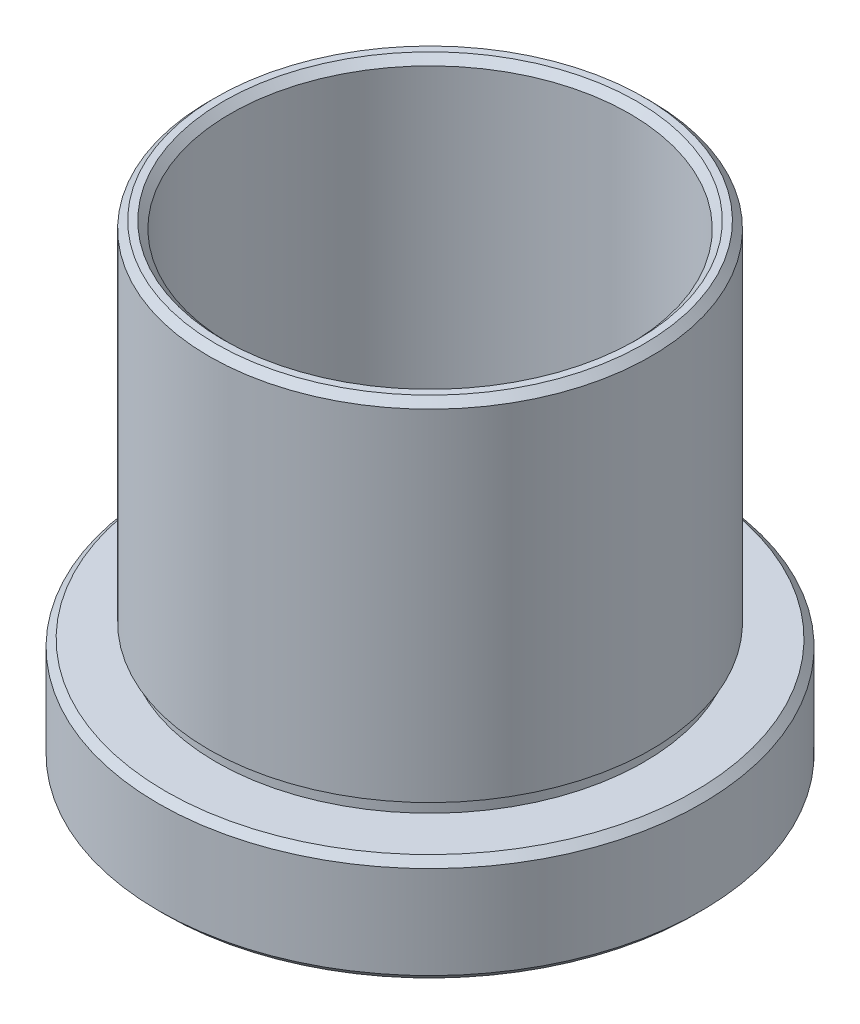
ISO-10303-21;
HEADER;
FILE_DESCRIPTION(('STEP AP214'),'2;1');
FILE_NAME('part.step','',(''),(''),'','','');
FILE_SCHEMA(('AUTOMOTIVE_DESIGN { 1 0 10303 214 1 1 1 1 }'));
ENDSEC;
DATA;
#1=APPLICATION_CONTEXT('core data for automotive mechanical design processes');
#2=APPLICATION_PROTOCOL_DEFINITION('international standard','automotive_design',2000,#1);
#3=PRODUCT_CONTEXT('',#1,'mechanical');
#4=PRODUCT('Part','Part','',(#3));
#5=PRODUCT_RELATED_PRODUCT_CATEGORY('part','',(#4));
#6=PRODUCT_DEFINITION_FORMATION('','',#4);
#7=PRODUCT_DEFINITION_CONTEXT('part definition',#1,'design');
#8=PRODUCT_DEFINITION('design','',#6,#7);
#9=PRODUCT_DEFINITION_SHAPE('','',#8);
#10=(LENGTH_UNIT() NAMED_UNIT(*) SI_UNIT(.MILLI.,.METRE.));
#11=(NAMED_UNIT(*) PLANE_ANGLE_UNIT() SI_UNIT($,.RADIAN.));
#12=(NAMED_UNIT(*) SI_UNIT($,.STERADIAN.) SOLID_ANGLE_UNIT());
#13=UNCERTAINTY_MEASURE_WITH_UNIT(LENGTH_MEASURE(1.E-05),#10,'distance_accuracy_value','');
#14=(GEOMETRIC_REPRESENTATION_CONTEXT(3) GLOBAL_UNCERTAINTY_ASSIGNED_CONTEXT((#13)) GLOBAL_UNIT_ASSIGNED_CONTEXT((#10,
#11,#12)) REPRESENTATION_CONTEXT('',''));
#15=CARTESIAN_POINT('',(0.,0.,0.));
#16=DIRECTION('',(0.,0.,1.));
#17=DIRECTION('',(1.,0.,0.));
#18=AXIS2_PLACEMENT_3D('',#15,#16,#17);
#19=CARTESIAN_POINT('',(15.5,2.64285417456689,0.));
#20=DIRECTION('',(0.,1.,0.));
#21=DIRECTION('',(0.,0.,1.));
#22=AXIS2_PLACEMENT_3D('',#19,#20,#21);
#23=PLANE('',#22);
#24=CARTESIAN_POINT('',(0.,2.6428541745669,0.));
#25=DIRECTION('',(0.,1.,0.));
#26=DIRECTION('',(0.,0.,1.));
#27=AXIS2_PLACEMENT_3D('',#24,#25,#26);
#28=CIRCLE('',#27,15.5);
#29=CARTESIAN_POINT('',(0.,2.6428541745669,15.5));
#30=VERTEX_POINT('',#29);
#31=EDGE_CURVE('E10',#30,#30,#28,.T.);
#32=ORIENTED_EDGE('',*,*,#31,.F.);
#33=EDGE_LOOP('',(#32));
#34=FACE_BOUND('',#33,.T.);
#35=CARTESIAN_POINT('',(0.,2.6428541745669,0.));
#36=DIRECTION('',(0.,1.,0.));
#37=DIRECTION('',(0.,0.,1.));
#38=AXIS2_PLACEMENT_3D('',#35,#36,#37);
#39=CIRCLE('',#38,15.);
#40=CARTESIAN_POINT('',(0.,2.6428541745669,15.));
#41=VERTEX_POINT('',#40);
#42=EDGE_CURVE('E112',#41,#41,#39,.T.);
#43=ORIENTED_EDGE('',*,*,#42,.T.);
#44=EDGE_LOOP('',(#43));
#45=FACE_BOUND('',#44,.T.);
#46=ADVANCED_FACE('F41',(#34,#45),#23,.F.);
#47=CARTESIAN_POINT('',(0.,44.5985977452931,0.));
#48=DIRECTION('',(0.,1.,0.));
#49=DIRECTION('',(0.,0.,1.));
#50=AXIS2_PLACEMENT_3D('',#47,#48,#49);
#51=CYLINDRICAL_SURFACE('',#50,15.5);
#52=CARTESIAN_POINT('',(0.,26.5428541745669,0.));
#53=DIRECTION('',(0.,1.,0.));
#54=DIRECTION('',(0.,0.,1.));
#55=AXIS2_PLACEMENT_3D('',#52,#53,#54);
#56=CIRCLE('',#55,15.5);
#57=CARTESIAN_POINT('',(0.,26.5428541745669,15.5));
#58=VERTEX_POINT('',#57);
#59=EDGE_CURVE('E48',#58,#58,#56,.T.);
#60=ORIENTED_EDGE('',*,*,#59,.F.);
#61=EDGE_LOOP('',(#60));
#62=FACE_BOUND('',#61,.T.);
#63=ORIENTED_EDGE('',*,*,#31,.T.);
#64=EDGE_LOOP('',(#63));
#65=FACE_BOUND('',#64,.T.);
#66=ADVANCED_FACE('F204',(#62,#65),#51,.T.);
#67=CARTESIAN_POINT('',(0.,26.5428541745669,0.));
#68=DIRECTION('',(0.,-1.,0.));
#69=DIRECTION('',(0.,0.,-1.));
#70=AXIS2_PLACEMENT_3D('',#67,#68,#69);
#71=CONICAL_SURFACE('',#70,15.5,0.785398163397448);
#72=CARTESIAN_POINT('',(0.,27.0428541745669,0.));
#73=DIRECTION('',(0.,1.,0.));
#74=DIRECTION('',(0.,0.,1.));
#75=AXIS2_PLACEMENT_3D('',#72,#73,#74);
#76=CIRCLE('',#75,15.);
#77=CARTESIAN_POINT('',(0.,27.0428541745669,15.));
#78=VERTEX_POINT('',#77);
#79=EDGE_CURVE('E54',#78,#78,#76,.T.);
#80=ORIENTED_EDGE('',*,*,#79,.F.);
#81=EDGE_LOOP('',(#80));
#82=FACE_BOUND('',#81,.T.);
#83=ORIENTED_EDGE('',*,*,#59,.T.);
#84=EDGE_LOOP('',(#83));
#85=FACE_BOUND('',#84,.T.);
#86=ADVANCED_FACE('F199',(#82,#85),#71,.T.);
#87=CARTESIAN_POINT('',(14.5,27.0428541745669,0.));
#88=DIRECTION('',(0.,-1.,0.));
#89=DIRECTION('',(0.,0.,-1.));
#90=AXIS2_PLACEMENT_3D('',#87,#88,#89);
#91=PLANE('',#90);
#92=CARTESIAN_POINT('',(0.,27.0428541745669,0.));
#93=DIRECTION('',(0.,1.,0.));
#94=DIRECTION('',(0.,0.,1.));
#95=AXIS2_PLACEMENT_3D('',#92,#93,#94);
#96=CIRCLE('',#95,14.5);
#97=CARTESIAN_POINT('',(0.,27.0428541745669,14.5));
#98=VERTEX_POINT('',#97);
#99=EDGE_CURVE('E59',#98,#98,#96,.T.);
#100=ORIENTED_EDGE('',*,*,#99,.F.);
#101=EDGE_LOOP('',(#100));
#102=FACE_BOUND('',#101,.T.);
#103=ORIENTED_EDGE('',*,*,#79,.T.);
#104=EDGE_LOOP('',(#103));
#105=FACE_BOUND('',#104,.T.);
#106=ADVANCED_FACE('F193',(#102,#105),#91,.F.);
#107=CARTESIAN_POINT('',(0.,27.0428541745669,0.));
#108=DIRECTION('',(0.,1.,0.));
#109=DIRECTION('',(0.,0.,1.));
#110=AXIS2_PLACEMENT_3D('',#107,#108,#109);
#111=CONICAL_SURFACE('',#110,14.5,0.78539816339745);
#112=CARTESIAN_POINT('',(0.,26.5428541745669,0.));
#113=DIRECTION('',(0.,1.,0.));
#114=DIRECTION('',(0.,0.,1.));
#115=AXIS2_PLACEMENT_3D('',#112,#113,#114);
#116=CIRCLE('',#115,14.);
#117=CARTESIAN_POINT('',(0.,26.5428541745669,14.));
#118=VERTEX_POINT('',#117);
#119=EDGE_CURVE('E65',#118,#118,#116,.T.);
#120=ORIENTED_EDGE('',*,*,#119,.F.);
#121=EDGE_LOOP('',(#120));
#122=FACE_BOUND('',#121,.T.);
#123=ORIENTED_EDGE('',*,*,#99,.T.);
#124=EDGE_LOOP('',(#123));
#125=FACE_BOUND('',#124,.T.);
#126=ADVANCED_FACE('F187',(#122,#125),#111,.F.);
#127=CARTESIAN_POINT('',(0.,44.5985977452931,0.));
#128=DIRECTION('',(0.,1.,0.));
#129=DIRECTION('',(0.,0.,1.));
#130=AXIS2_PLACEMENT_3D('',#127,#128,#129);
#131=CYLINDRICAL_SURFACE('',#130,14.);
#132=CARTESIAN_POINT('',(0.,-0.357145825433107,0.));
#133=DIRECTION('',(0.,1.,0.));
#134=DIRECTION('',(0.,0.,1.));
#135=AXIS2_PLACEMENT_3D('',#132,#133,#134);
#136=CIRCLE('',#135,14.);
#137=CARTESIAN_POINT('',(0.,-0.357145825433107,14.));
#138=VERTEX_POINT('',#137);
#139=EDGE_CURVE('E68',#138,#138,#136,.T.);
#140=ORIENTED_EDGE('',*,*,#139,.F.);
#141=EDGE_LOOP('',(#140));
#142=FACE_BOUND('',#141,.T.);
#143=ORIENTED_EDGE('',*,*,#119,.T.);
#144=EDGE_LOOP('',(#143));
#145=FACE_BOUND('',#144,.T.);
#146=ADVANCED_FACE('F181',(#142,#145),#131,.F.);
#147=CARTESIAN_POINT('',(17.6,-0.357145825433105,0.));
#148=DIRECTION('',(0.,1.,0.));
#149=DIRECTION('',(0.,0.,1.));
#150=AXIS2_PLACEMENT_3D('',#147,#148,#149);
#151=PLANE('',#150);
#152=CARTESIAN_POINT('',(0.,-0.357145825433107,0.));
#153=DIRECTION('',(0.,1.,0.));
#154=DIRECTION('',(0.,0.,1.));
#155=AXIS2_PLACEMENT_3D('',#152,#153,#154);
#156=CIRCLE('',#155,17.6);
#157=CARTESIAN_POINT('',(0.,-0.357145825433107,17.6));
#158=VERTEX_POINT('',#157);
#159=EDGE_CURVE('E72',#158,#158,#156,.T.);
#160=ORIENTED_EDGE('',*,*,#159,.F.);
#161=EDGE_LOOP('',(#160));
#162=FACE_BOUND('',#161,.T.);
#163=ORIENTED_EDGE('',*,*,#139,.T.);
#164=EDGE_LOOP('',(#163));
#165=FACE_BOUND('',#164,.T.);
#166=ADVANCED_FACE('F175',(#162,#165),#151,.F.);
#167=CARTESIAN_POINT('',(0.,44.5985977452931,0.));
#168=DIRECTION('',(0.,1.,0.));
#169=DIRECTION('',(0.,0.,1.));
#170=AXIS2_PLACEMENT_3D('',#167,#168,#169);
#171=CYLINDRICAL_SURFACE('',#170,17.6);
#172=CARTESIAN_POINT('',(0.,-1.35714582543311,0.));
#173=DIRECTION('',(0.,1.,0.));
#174=DIRECTION('',(0.,0.,1.));
#175=AXIS2_PLACEMENT_3D('',#172,#173,#174);
#176=CIRCLE('',#175,17.6);
#177=CARTESIAN_POINT('',(0.,-1.35714582543311,17.6));
#178=VERTEX_POINT('',#177);
#179=EDGE_CURVE('E76',#178,#178,#176,.T.);
#180=ORIENTED_EDGE('',*,*,#179,.F.);
#181=EDGE_LOOP('',(#180));
#182=FACE_BOUND('',#181,.T.);
#183=ORIENTED_EDGE('',*,*,#159,.T.);
#184=EDGE_LOOP('',(#183));
#185=FACE_BOUND('',#184,.T.);
#186=ADVANCED_FACE('F169',(#182,#185),#171,.F.);
#187=CARTESIAN_POINT('',(17.5,-1.35714582543311,0.));
#188=DIRECTION('',(0.,-1.,0.));
#189=DIRECTION('',(0.,0.,-1.));
#190=AXIS2_PLACEMENT_3D('',#187,#188,#189);
#191=PLANE('',#190);
#192=CARTESIAN_POINT('',(0.,-1.35714582543311,0.));
#193=DIRECTION('',(0.,1.,0.));
#194=DIRECTION('',(0.,0.,1.));
#195=AXIS2_PLACEMENT_3D('',#192,#193,#194);
#196=CIRCLE('',#195,17.5);
#197=CARTESIAN_POINT('',(0.,-1.35714582543311,17.5));
#198=VERTEX_POINT('',#197);
#199=EDGE_CURVE('E80',#198,#198,#196,.T.);
#200=ORIENTED_EDGE('',*,*,#199,.F.);
#201=EDGE_LOOP('',(#200));
#202=FACE_BOUND('',#201,.T.);
#203=ORIENTED_EDGE('',*,*,#179,.T.);
#204=EDGE_LOOP('',(#203));
#205=FACE_BOUND('',#204,.T.);
#206=ADVANCED_FACE('F163',(#202,#205),#191,.F.);
#207=CARTESIAN_POINT('',(0.,44.5985977452931,0.));
#208=DIRECTION('',(0.,1.,0.));
#209=DIRECTION('',(0.,0.,1.));
#210=AXIS2_PLACEMENT_3D('',#207,#208,#209);
#211=CYLINDRICAL_SURFACE('',#210,17.5);
#212=CARTESIAN_POINT('',(0.,-5.3571458254331,0.));
#213=DIRECTION('',(0.,1.,0.));
#214=DIRECTION('',(0.,0.,1.));
#215=AXIS2_PLACEMENT_3D('',#212,#213,#214);
#216=CIRCLE('',#215,17.5);
#217=CARTESIAN_POINT('',(0.,-5.3571458254331,17.5));
#218=VERTEX_POINT('',#217);
#219=EDGE_CURVE('E84',#218,#218,#216,.T.);
#220=ORIENTED_EDGE('',*,*,#219,.F.);
#221=EDGE_LOOP('',(#220));
#222=FACE_BOUND('',#221,.T.);
#223=ORIENTED_EDGE('',*,*,#199,.T.);
#224=EDGE_LOOP('',(#223));
#225=FACE_BOUND('',#224,.T.);
#226=ADVANCED_FACE('F157',(#222,#225),#211,.F.);
#227=CARTESIAN_POINT('',(0.,-5.3571458254331,0.));
#228=DIRECTION('',(0.,-1.,0.));
#229=DIRECTION('',(0.,0.,-1.));
#230=AXIS2_PLACEMENT_3D('',#227,#228,#229);
#231=CONICAL_SURFACE('',#230,17.5,0.785398163397448);
#232=CARTESIAN_POINT('',(0.,-5.85714582543311,0.));
#233=DIRECTION('',(0.,1.,0.));
#234=DIRECTION('',(0.,0.,1.));
#235=AXIS2_PLACEMENT_3D('',#232,#233,#234);
#236=CIRCLE('',#235,18.);
#237=CARTESIAN_POINT('',(0.,-5.85714582543311,18.));
#238=VERTEX_POINT('',#237);
#239=EDGE_CURVE('E88',#238,#238,#236,.T.);
#240=ORIENTED_EDGE('',*,*,#239,.F.);
#241=EDGE_LOOP('',(#240));
#242=FACE_BOUND('',#241,.T.);
#243=ORIENTED_EDGE('',*,*,#219,.T.);
#244=EDGE_LOOP('',(#243));
#245=FACE_BOUND('',#244,.T.);
#246=ADVANCED_FACE('F151',(#242,#245),#231,.F.);
#247=CARTESIAN_POINT('',(18.55,-5.85714582543311,0.));
#248=DIRECTION('',(0.,1.,0.));
#249=DIRECTION('',(0.,0.,1.));
#250=AXIS2_PLACEMENT_3D('',#247,#248,#249);
#251=PLANE('',#250);
#252=CARTESIAN_POINT('',(0.,-5.85714582543311,0.));
#253=DIRECTION('',(0.,1.,0.));
#254=DIRECTION('',(0.,0.,1.));
#255=AXIS2_PLACEMENT_3D('',#252,#253,#254);
#256=CIRCLE('',#255,18.55);
#257=CARTESIAN_POINT('',(0.,-5.85714582543311,18.55));
#258=VERTEX_POINT('',#257);
#259=EDGE_CURVE('E92',#258,#258,#256,.T.);
#260=ORIENTED_EDGE('',*,*,#259,.F.);
#261=EDGE_LOOP('',(#260));
#262=FACE_BOUND('',#261,.T.);
#263=ORIENTED_EDGE('',*,*,#239,.T.);
#264=EDGE_LOOP('',(#263));
#265=FACE_BOUND('',#264,.T.);
#266=ADVANCED_FACE('F145',(#262,#265),#251,.F.);
#267=CARTESIAN_POINT('',(0.,-5.85714582543311,0.));
#268=DIRECTION('',(0.,1.,0.));
#269=DIRECTION('',(0.,0.,1.));
#270=AXIS2_PLACEMENT_3D('',#267,#268,#269);
#271=CONICAL_SURFACE('',#270,18.55,0.785398163397448);
#272=CARTESIAN_POINT('',(0.,-5.3571458254331,0.));
#273=DIRECTION('',(0.,1.,0.));
#274=DIRECTION('',(0.,0.,1.));
#275=AXIS2_PLACEMENT_3D('',#272,#273,#274);
#276=CIRCLE('',#275,19.05);
#277=CARTESIAN_POINT('',(0.,-5.3571458254331,19.05));
#278=VERTEX_POINT('',#277);
#279=EDGE_CURVE('E96',#278,#278,#276,.T.);
#280=ORIENTED_EDGE('',*,*,#279,.F.);
#281=EDGE_LOOP('',(#280));
#282=FACE_BOUND('',#281,.T.);
#283=ORIENTED_EDGE('',*,*,#259,.T.);
#284=EDGE_LOOP('',(#283));
#285=FACE_BOUND('',#284,.T.);
#286=ADVANCED_FACE('F139',(#282,#285),#271,.T.);
#287=CARTESIAN_POINT('',(0.,44.5985977452931,0.));
#288=DIRECTION('',(0.,1.,0.));
#289=DIRECTION('',(0.,0.,1.));
#290=AXIS2_PLACEMENT_3D('',#287,#288,#289);
#291=CYLINDRICAL_SURFACE('',#290,19.05);
#292=CARTESIAN_POINT('',(0.,1.14285417456689,0.));
#293=DIRECTION('',(0.,1.,0.));
#294=DIRECTION('',(0.,0.,1.));
#295=AXIS2_PLACEMENT_3D('',#292,#293,#294);
#296=CIRCLE('',#295,19.05);
#297=CARTESIAN_POINT('',(0.,1.14285417456689,19.05));
#298=VERTEX_POINT('',#297);
#299=EDGE_CURVE('E100',#298,#298,#296,.T.);
#300=ORIENTED_EDGE('',*,*,#299,.F.);
#301=EDGE_LOOP('',(#300));
#302=FACE_BOUND('',#301,.T.);
#303=ORIENTED_EDGE('',*,*,#279,.T.);
#304=EDGE_LOOP('',(#303));
#305=FACE_BOUND('',#304,.T.);
#306=ADVANCED_FACE('F133',(#302,#305),#291,.T.);
#307=CARTESIAN_POINT('',(0.,1.14285417456689,0.));
#308=DIRECTION('',(0.,-1.,0.));
#309=DIRECTION('',(0.,0.,-1.));
#310=AXIS2_PLACEMENT_3D('',#307,#308,#309);
#311=CONICAL_SURFACE('',#310,19.05,0.785398163397445);
#312=CARTESIAN_POINT('',(0.,1.64285417456689,0.));
#313=DIRECTION('',(0.,1.,0.));
#314=DIRECTION('',(0.,0.,1.));
#315=AXIS2_PLACEMENT_3D('',#312,#313,#314);
#316=CIRCLE('',#315,18.55);
#317=CARTESIAN_POINT('',(0.,1.64285417456689,18.55));
#318=VERTEX_POINT('',#317);
#319=EDGE_CURVE('E104',#318,#318,#316,.T.);
#320=ORIENTED_EDGE('',*,*,#319,.F.);
#321=EDGE_LOOP('',(#320));
#322=FACE_BOUND('',#321,.T.);
#323=ORIENTED_EDGE('',*,*,#299,.T.);
#324=EDGE_LOOP('',(#323));
#325=FACE_BOUND('',#324,.T.);
#326=ADVANCED_FACE('F127',(#322,#325),#311,.T.);
#327=CARTESIAN_POINT('',(15.,1.64285417456689,0.));
#328=DIRECTION('',(0.,-1.,0.));
#329=DIRECTION('',(0.,0.,-1.));
#330=AXIS2_PLACEMENT_3D('',#327,#328,#329);
#331=PLANE('',#330);
#332=CARTESIAN_POINT('',(0.,1.64285417456689,0.));
#333=DIRECTION('',(0.,1.,0.));
#334=DIRECTION('',(0.,0.,1.));
#335=AXIS2_PLACEMENT_3D('',#332,#333,#334);
#336=CIRCLE('',#335,15.);
#337=CARTESIAN_POINT('',(0.,1.64285417456689,15.));
#338=VERTEX_POINT('',#337);
#339=EDGE_CURVE('E108',#338,#338,#336,.T.);
#340=ORIENTED_EDGE('',*,*,#339,.F.);
#341=EDGE_LOOP('',(#340));
#342=FACE_BOUND('',#341,.T.);
#343=ORIENTED_EDGE('',*,*,#319,.T.);
#344=EDGE_LOOP('',(#343));
#345=FACE_BOUND('',#344,.T.);
#346=ADVANCED_FACE('F121',(#342,#345),#331,.F.);
#347=CARTESIAN_POINT('',(0.,44.5985977452931,0.));
#348=DIRECTION('',(0.,1.,0.));
#349=DIRECTION('',(0.,0.,1.));
#350=AXIS2_PLACEMENT_3D('',#347,#348,#349);
#351=CYLINDRICAL_SURFACE('',#350,15.);
#352=ORIENTED_EDGE('',*,*,#42,.F.);
#353=EDGE_LOOP('',(#352));
#354=FACE_BOUND('',#353,.T.);
#355=ORIENTED_EDGE('',*,*,#339,.T.);
#356=EDGE_LOOP('',(#355));
#357=FACE_BOUND('',#356,.T.);
#358=ADVANCED_FACE('F118',(#354,#357),#351,.T.);
#359=CLOSED_SHELL('',(#46,#66,#86,#106,#126,#146,#166,#186,#206,#226,#246,#266,#286,#306,#326,
#346,#358));
#360=MANIFOLD_SOLID_BREP('B2',#359);
#361=ADVANCED_BREP_SHAPE_REPRESENTATION('',(#18,#360),#14);
#362=SHAPE_DEFINITION_REPRESENTATION(#9,#361);
ENDSEC;
END-ISO-10303-21;
